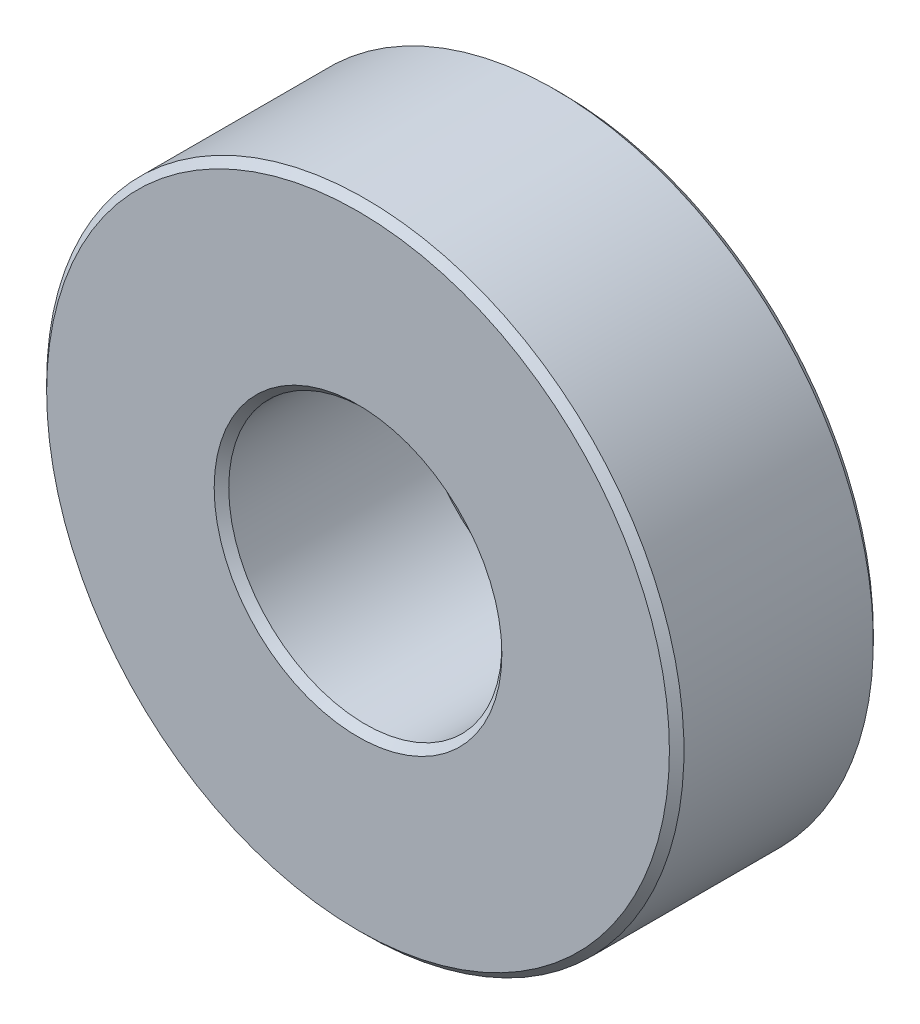
ISO-10303-21;
HEADER;
FILE_DESCRIPTION(('STEP AP214'),'2;1');
FILE_NAME('part.step','',(''),(''),'','','');
FILE_SCHEMA(('AUTOMOTIVE_DESIGN { 1 0 10303 214 1 1 1 1 }'));
ENDSEC;
DATA;
#1=APPLICATION_CONTEXT('core data for automotive mechanical design processes');
#2=APPLICATION_PROTOCOL_DEFINITION('international standard','automotive_design',2000,#1);
#3=PRODUCT_CONTEXT('',#1,'mechanical');
#4=PRODUCT('Part','Part','',(#3));
#5=PRODUCT_RELATED_PRODUCT_CATEGORY('part','',(#4));
#6=PRODUCT_DEFINITION_FORMATION('','',#4);
#7=PRODUCT_DEFINITION_CONTEXT('part definition',#1,'design');
#8=PRODUCT_DEFINITION('design','',#6,#7);
#9=PRODUCT_DEFINITION_SHAPE('','',#8);
#10=(LENGTH_UNIT() NAMED_UNIT(*) SI_UNIT(.MILLI.,.METRE.));
#11=(NAMED_UNIT(*) PLANE_ANGLE_UNIT() SI_UNIT($,.RADIAN.));
#12=(NAMED_UNIT(*) SI_UNIT($,.STERADIAN.) SOLID_ANGLE_UNIT());
#13=UNCERTAINTY_MEASURE_WITH_UNIT(LENGTH_MEASURE(1.E-05),#10,'distance_accuracy_value','');
#14=(GEOMETRIC_REPRESENTATION_CONTEXT(3) GLOBAL_UNCERTAINTY_ASSIGNED_CONTEXT((#13)) GLOBAL_UNIT_ASSIGNED_CONTEXT((#10,
#11,#12)) REPRESENTATION_CONTEXT('',''));
#15=CARTESIAN_POINT('',(0.,0.,0.));
#16=DIRECTION('',(0.,0.,1.));
#17=DIRECTION('',(1.,0.,0.));
#18=AXIS2_PLACEMENT_3D('',#15,#16,#17);
#19=CARTESIAN_POINT('',(0.,0.,7.112));
#20=DIRECTION('',(0.,0.,-1.));
#21=DIRECTION('',(-1.,0.,0.));
#22=AXIS2_PLACEMENT_3D('',#19,#20,#21);
#23=CYLINDRICAL_SURFACE('',#22,4.7625);
#24=CARTESIAN_POINT('',(0.,0.,0.254));
#25=DIRECTION('',(0.,0.,-1.));
#26=DIRECTION('',(-1.,0.,0.));
#27=AXIS2_PLACEMENT_3D('',#24,#25,#26);
#28=CIRCLE('',#27,4.7625);
#29=CARTESIAN_POINT('',(-4.7625,0.,0.254));
#30=VERTEX_POINT('',#29);
#31=EDGE_CURVE('E8',#30,#30,#28,.T.);
#32=ORIENTED_EDGE('',*,*,#31,.T.);
#33=EDGE_LOOP('',(#32));
#34=FACE_BOUND('',#33,.T.);
#35=CARTESIAN_POINT('',(0.,0.,6.858));
#36=DIRECTION('',(0.,0.,-1.));
#37=DIRECTION('',(-1.,0.,0.));
#38=AXIS2_PLACEMENT_3D('',#35,#36,#37);
#39=CIRCLE('',#38,4.7625);
#40=CARTESIAN_POINT('',(-4.7625,0.,6.858));
#41=VERTEX_POINT('',#40);
#42=EDGE_CURVE('E19',#41,#41,#39,.F.);
#43=ORIENTED_EDGE('',*,*,#42,.T.);
#44=EDGE_LOOP('',(#43));
#45=FACE_BOUND('',#44,.T.);
#46=ADVANCED_FACE('F12',(#34,#45),#23,.F.);
#47=CARTESIAN_POINT('',(0.,0.,7.112));
#48=DIRECTION('',(0.,0.,-1.));
#49=DIRECTION('',(-1.,0.,0.));
#50=AXIS2_PLACEMENT_3D('',#47,#48,#49);
#51=CYLINDRICAL_SURFACE('',#50,11.1125);
#52=CARTESIAN_POINT('',(0.,0.,0.254));
#53=DIRECTION('',(0.,0.,-1.));
#54=DIRECTION('',(-1.,0.,0.));
#55=AXIS2_PLACEMENT_3D('',#52,#53,#54);
#56=CIRCLE('',#55,11.1125);
#57=CARTESIAN_POINT('',(-11.1125,0.,0.254));
#58=VERTEX_POINT('',#57);
#59=EDGE_CURVE('E32',#58,#58,#56,.F.);
#60=ORIENTED_EDGE('',*,*,#59,.T.);
#61=EDGE_LOOP('',(#60));
#62=FACE_BOUND('',#61,.T.);
#63=CARTESIAN_POINT('',(0.,0.,6.858));
#64=DIRECTION('',(0.,0.,-1.));
#65=DIRECTION('',(-1.,0.,0.));
#66=AXIS2_PLACEMENT_3D('',#63,#64,#65);
#67=CIRCLE('',#66,11.1125);
#68=CARTESIAN_POINT('',(-11.1125,0.,6.858));
#69=VERTEX_POINT('',#68);
#70=EDGE_CURVE('E35',#69,#69,#67,.T.);
#71=ORIENTED_EDGE('',*,*,#70,.T.);
#72=EDGE_LOOP('',(#71));
#73=FACE_BOUND('',#72,.T.);
#74=ADVANCED_FACE('F14',(#62,#73),#51,.T.);
#75=CARTESIAN_POINT('',(0.,0.,7.112));
#76=DIRECTION('',(0.,0.,-1.));
#77=DIRECTION('',(-1.,0.,0.));
#78=AXIS2_PLACEMENT_3D('',#75,#76,#77);
#79=PLANE('',#78);
#80=CARTESIAN_POINT('',(0.,0.,7.112));
#81=DIRECTION('',(0.,0.,-1.));
#82=DIRECTION('',(-1.,0.,0.));
#83=AXIS2_PLACEMENT_3D('',#80,#81,#82);
#84=CIRCLE('',#83,10.8585);
#85=CARTESIAN_POINT('',(-10.8585,0.,7.112));
#86=VERTEX_POINT('',#85);
#87=EDGE_CURVE('E23',#86,#86,#84,.F.);
#88=ORIENTED_EDGE('',*,*,#87,.T.);
#89=EDGE_LOOP('',(#88));
#90=FACE_BOUND('',#89,.T.);
#91=CARTESIAN_POINT('',(0.,0.,7.112));
#92=DIRECTION('',(0.,0.,-1.));
#93=DIRECTION('',(-1.,0.,0.));
#94=AXIS2_PLACEMENT_3D('',#91,#92,#93);
#95=CIRCLE('',#94,5.0165);
#96=CARTESIAN_POINT('',(-5.0165,0.,7.112));
#97=VERTEX_POINT('',#96);
#98=EDGE_CURVE('E27',#97,#97,#95,.T.);
#99=ORIENTED_EDGE('',*,*,#98,.T.);
#100=EDGE_LOOP('',(#99));
#101=FACE_BOUND('',#100,.T.);
#102=ADVANCED_FACE('F67',(#90,#101),#79,.F.);
#103=CARTESIAN_POINT('',(0.,0.,0.));
#104=DIRECTION('',(0.,0.,-1.));
#105=DIRECTION('',(-1.,0.,0.));
#106=AXIS2_PLACEMENT_3D('',#103,#104,#105);
#107=PLANE('',#106);
#108=CARTESIAN_POINT('',(0.,0.,0.));
#109=DIRECTION('',(0.,0.,-1.));
#110=DIRECTION('',(-1.,0.,0.));
#111=AXIS2_PLACEMENT_3D('',#108,#109,#110);
#112=CIRCLE('',#111,10.8585);
#113=CARTESIAN_POINT('',(-10.8585,0.,0.));
#114=VERTEX_POINT('',#113);
#115=EDGE_CURVE('E38',#114,#114,#112,.T.);
#116=ORIENTED_EDGE('',*,*,#115,.T.);
#117=EDGE_LOOP('',(#116));
#118=FACE_BOUND('',#117,.T.);
#119=CARTESIAN_POINT('',(0.,0.,0.));
#120=DIRECTION('',(0.,0.,-1.));
#121=DIRECTION('',(-1.,0.,0.));
#122=AXIS2_PLACEMENT_3D('',#119,#120,#121);
#123=CIRCLE('',#122,5.0165);
#124=CARTESIAN_POINT('',(-5.0165,0.,0.));
#125=VERTEX_POINT('',#124);
#126=EDGE_CURVE('E41',#125,#125,#123,.F.);
#127=ORIENTED_EDGE('',*,*,#126,.T.);
#128=EDGE_LOOP('',(#127));
#129=FACE_BOUND('',#128,.T.);
#130=ADVANCED_FACE('F45',(#118,#129),#107,.T.);
#131=CARTESIAN_POINT('',(0.,0.,0.));
#132=DIRECTION('',(0.,0.,1.));
#133=DIRECTION('',(1.,0.,0.));
#134=AXIS2_PLACEMENT_3D('',#131,#132,#133);
#135=CONICAL_SURFACE('',#134,10.8585,0.78539816339745);
#136=ORIENTED_EDGE('',*,*,#59,.F.);
#137=EDGE_LOOP('',(#136));
#138=FACE_BOUND('',#137,.T.);
#139=ORIENTED_EDGE('',*,*,#115,.F.);
#140=EDGE_LOOP('',(#139));
#141=FACE_BOUND('',#140,.T.);
#142=ADVANCED_FACE('F60',(#138,#141),#135,.T.);
#143=CARTESIAN_POINT('',(0.,0.,6.858));
#144=DIRECTION('',(0.,0.,-1.));
#145=DIRECTION('',(-1.,0.,0.));
#146=AXIS2_PLACEMENT_3D('',#143,#144,#145);
#147=CONICAL_SURFACE('',#146,11.1125,0.78539816339745);
#148=ORIENTED_EDGE('',*,*,#87,.F.);
#149=EDGE_LOOP('',(#148));
#150=FACE_BOUND('',#149,.T.);
#151=ORIENTED_EDGE('',*,*,#70,.F.);
#152=EDGE_LOOP('',(#151));
#153=FACE_BOUND('',#152,.T.);
#154=ADVANCED_FACE('F51',(#150,#153),#147,.T.);
#155=CARTESIAN_POINT('',(0.,0.,0.254));
#156=DIRECTION('',(0.,0.,-1.));
#157=DIRECTION('',(-1.,0.,0.));
#158=AXIS2_PLACEMENT_3D('',#155,#156,#157);
#159=CONICAL_SURFACE('',#158,4.7625,0.785398163397448);
#160=ORIENTED_EDGE('',*,*,#126,.F.);
#161=EDGE_LOOP('',(#160));
#162=FACE_BOUND('',#161,.T.);
#163=ORIENTED_EDGE('',*,*,#31,.F.);
#164=EDGE_LOOP('',(#163));
#165=FACE_BOUND('',#164,.T.);
#166=ADVANCED_FACE('F47',(#162,#165),#159,.F.);
#167=CARTESIAN_POINT('',(0.,0.,7.112));
#168=DIRECTION('',(0.,0.,1.));
#169=DIRECTION('',(1.,0.,0.));
#170=AXIS2_PLACEMENT_3D('',#167,#168,#169);
#171=CONICAL_SURFACE('',#170,5.0165,0.785398163397448);
#172=ORIENTED_EDGE('',*,*,#42,.F.);
#173=EDGE_LOOP('',(#172));
#174=FACE_BOUND('',#173,.T.);
#175=ORIENTED_EDGE('',*,*,#98,.F.);
#176=EDGE_LOOP('',(#175));
#177=FACE_BOUND('',#176,.T.);
#178=ADVANCED_FACE('F50',(#174,#177),#171,.F.);
#179=CLOSED_SHELL('',(#46,#74,#102,#130,#142,#154,#166,#178));
#180=MANIFOLD_SOLID_BREP('B1',#179);
#181=ADVANCED_BREP_SHAPE_REPRESENTATION('',(#18,#180),#14);
#182=SHAPE_DEFINITION_REPRESENTATION(#9,#181);
ENDSEC;
END-ISO-10303-21;
